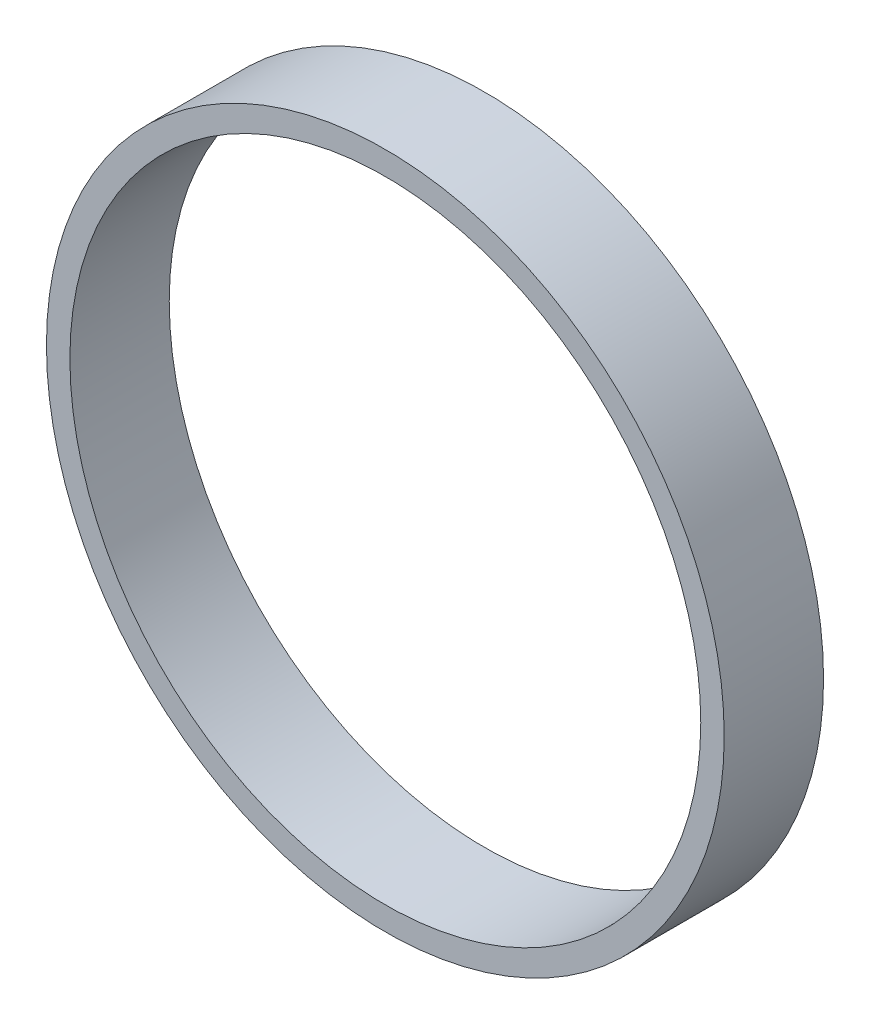
ISO-10303-21;
HEADER;
FILE_DESCRIPTION(('STEP AP214'),'2;1');
FILE_NAME('part.step','',(''),(''),'','','');
FILE_SCHEMA(('AUTOMOTIVE_DESIGN { 1 0 10303 214 1 1 1 1 }'));
ENDSEC;
DATA;
#1=APPLICATION_CONTEXT('core data for automotive mechanical design processes');
#2=APPLICATION_PROTOCOL_DEFINITION('international standard','automotive_design',2000,#1);
#3=PRODUCT_CONTEXT('',#1,'mechanical');
#4=PRODUCT('Part','Part','',(#3));
#5=PRODUCT_RELATED_PRODUCT_CATEGORY('part','',(#4));
#6=PRODUCT_DEFINITION_FORMATION('','',#4);
#7=PRODUCT_DEFINITION_CONTEXT('part definition',#1,'design');
#8=PRODUCT_DEFINITION('design','',#6,#7);
#9=PRODUCT_DEFINITION_SHAPE('','',#8);
#10=(LENGTH_UNIT() NAMED_UNIT(*) SI_UNIT(.MILLI.,.METRE.));
#11=(NAMED_UNIT(*) PLANE_ANGLE_UNIT() SI_UNIT($,.RADIAN.));
#12=(NAMED_UNIT(*) SI_UNIT($,.STERADIAN.) SOLID_ANGLE_UNIT());
#13=UNCERTAINTY_MEASURE_WITH_UNIT(LENGTH_MEASURE(1.E-05),#10,'distance_accuracy_value','');
#14=(GEOMETRIC_REPRESENTATION_CONTEXT(3) GLOBAL_UNCERTAINTY_ASSIGNED_CONTEXT((#13)) GLOBAL_UNIT_ASSIGNED_CONTEXT((#10,
#11,#12)) REPRESENTATION_CONTEXT('',''));
#15=CARTESIAN_POINT('',(0.,0.,0.));
#16=DIRECTION('',(0.,0.,1.));
#17=DIRECTION('',(1.,0.,0.));
#18=AXIS2_PLACEMENT_3D('',#15,#16,#17);
#19=CARTESIAN_POINT('',(0.,0.,10.));
#20=DIRECTION('',(0.,0.,1.));
#21=DIRECTION('',(1.,0.,0.));
#22=AXIS2_PLACEMENT_3D('',#19,#20,#21);
#23=PLANE('',#22);
#24=CARTESIAN_POINT('',(0.,0.,10.));
#25=DIRECTION('',(0.,0.,1.));
#26=DIRECTION('',(1.,0.,0.));
#27=AXIS2_PLACEMENT_3D('',#24,#25,#26);
#28=CIRCLE('',#27,34.11);
#29=CARTESIAN_POINT('',(34.11,0.,10.));
#30=VERTEX_POINT('',#29);
#31=EDGE_CURVE('E10',#30,#30,#28,.T.);
#32=ORIENTED_EDGE('',*,*,#31,.T.);
#33=EDGE_LOOP('',(#32));
#34=FACE_BOUND('',#33,.T.);
#35=CARTESIAN_POINT('',(0.,0.,10.));
#36=DIRECTION('',(0.,0.,1.));
#37=DIRECTION('',(1.,0.,0.));
#38=AXIS2_PLACEMENT_3D('',#35,#36,#37);
#39=CIRCLE('',#38,31.75);
#40=CARTESIAN_POINT('',(31.75,0.,10.));
#41=VERTEX_POINT('',#40);
#42=EDGE_CURVE('E52',#41,#41,#39,.T.);
#43=ORIENTED_EDGE('',*,*,#42,.F.);
#44=EDGE_LOOP('',(#43));
#45=FACE_BOUND('',#44,.T.);
#46=ADVANCED_FACE('F41',(#34,#45),#23,.T.);
#47=CARTESIAN_POINT('',(0.,0.,0.));
#48=DIRECTION('',(0.,0.,1.));
#49=DIRECTION('',(1.,0.,0.));
#50=AXIS2_PLACEMENT_3D('',#47,#48,#49);
#51=PLANE('',#50);
#52=CARTESIAN_POINT('',(0.,0.,0.));
#53=DIRECTION('',(0.,0.,1.));
#54=DIRECTION('',(1.,0.,0.));
#55=AXIS2_PLACEMENT_3D('',#52,#53,#54);
#56=CIRCLE('',#55,34.11);
#57=CARTESIAN_POINT('',(34.11,0.,0.));
#58=VERTEX_POINT('',#57);
#59=EDGE_CURVE('E45',#58,#58,#56,.T.);
#60=ORIENTED_EDGE('',*,*,#59,.F.);
#61=EDGE_LOOP('',(#60));
#62=FACE_BOUND('',#61,.T.);
#63=CARTESIAN_POINT('',(0.,0.,0.));
#64=DIRECTION('',(0.,0.,1.));
#65=DIRECTION('',(1.,0.,0.));
#66=AXIS2_PLACEMENT_3D('',#63,#64,#65);
#67=CIRCLE('',#66,31.75);
#68=CARTESIAN_POINT('',(31.75,0.,0.));
#69=VERTEX_POINT('',#68);
#70=EDGE_CURVE('E54',#69,#69,#67,.T.);
#71=ORIENTED_EDGE('',*,*,#70,.T.);
#72=EDGE_LOOP('',(#71));
#73=FACE_BOUND('',#72,.T.);
#74=ADVANCED_FACE('F64',(#62,#73),#51,.F.);
#75=CARTESIAN_POINT('',(0.,0.,10.));
#76=DIRECTION('',(0.,0.,-1.));
#77=DIRECTION('',(-1.,0.,0.));
#78=AXIS2_PLACEMENT_3D('',#75,#76,#77);
#79=CYLINDRICAL_SURFACE('',#78,34.11);
#80=ORIENTED_EDGE('',*,*,#31,.F.);
#81=EDGE_LOOP('',(#80));
#82=FACE_BOUND('',#81,.T.);
#83=ORIENTED_EDGE('',*,*,#59,.T.);
#84=EDGE_LOOP('',(#83));
#85=FACE_BOUND('',#84,.T.);
#86=ADVANCED_FACE('F43',(#82,#85),#79,.T.);
#87=CARTESIAN_POINT('',(0.,0.,10.));
#88=DIRECTION('',(0.,0.,-1.));
#89=DIRECTION('',(-1.,0.,0.));
#90=AXIS2_PLACEMENT_3D('',#87,#88,#89);
#91=CYLINDRICAL_SURFACE('',#90,31.75);
#92=ORIENTED_EDGE('',*,*,#42,.T.);
#93=EDGE_LOOP('',(#92));
#94=FACE_BOUND('',#93,.T.);
#95=ORIENTED_EDGE('',*,*,#70,.F.);
#96=EDGE_LOOP('',(#95));
#97=FACE_BOUND('',#96,.T.);
#98=ADVANCED_FACE('F60',(#94,#97),#91,.F.);
#99=CLOSED_SHELL('',(#46,#74,#86,#98));
#100=MANIFOLD_SOLID_BREP('B2',#99);
#101=ADVANCED_BREP_SHAPE_REPRESENTATION('',(#18,#100),#14);
#102=SHAPE_DEFINITION_REPRESENTATION(#9,#101);
ENDSEC;
END-ISO-10303-21;
